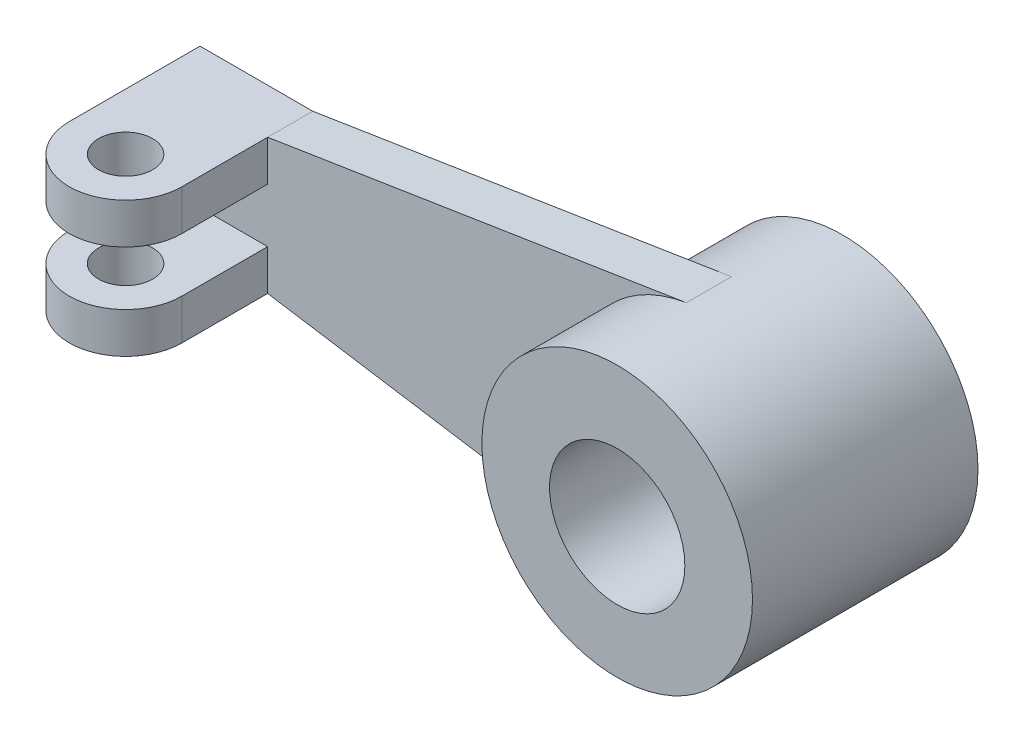
ISO-10303-21;
HEADER;
FILE_DESCRIPTION(('STEP AP214'),'2;1');
FILE_NAME('part.step','',(''),(''),'','','');
FILE_SCHEMA(('AUTOMOTIVE_DESIGN { 1 0 10303 214 1 1 1 1 }'));
ENDSEC;
DATA;
#1=APPLICATION_CONTEXT('core data for automotive mechanical design processes');
#2=APPLICATION_PROTOCOL_DEFINITION('international standard','automotive_design',2000,#1);
#3=PRODUCT_CONTEXT('',#1,'mechanical');
#4=PRODUCT('Part','Part','',(#3));
#5=PRODUCT_RELATED_PRODUCT_CATEGORY('part','',(#4));
#6=PRODUCT_DEFINITION_FORMATION('','',#4);
#7=PRODUCT_DEFINITION_CONTEXT('part definition',#1,'design');
#8=PRODUCT_DEFINITION('design','',#6,#7);
#9=PRODUCT_DEFINITION_SHAPE('','',#8);
#10=(LENGTH_UNIT() NAMED_UNIT(*) SI_UNIT(.MILLI.,.METRE.));
#11=(NAMED_UNIT(*) PLANE_ANGLE_UNIT() SI_UNIT($,.RADIAN.));
#12=(NAMED_UNIT(*) SI_UNIT($,.STERADIAN.) SOLID_ANGLE_UNIT());
#13=UNCERTAINTY_MEASURE_WITH_UNIT(LENGTH_MEASURE(1.E-05),#10,'distance_accuracy_value','');
#14=(GEOMETRIC_REPRESENTATION_CONTEXT(3) GLOBAL_UNCERTAINTY_ASSIGNED_CONTEXT((#13)) GLOBAL_UNIT_ASSIGNED_CONTEXT((#10,
#11,#12)) REPRESENTATION_CONTEXT('',''));
#15=CARTESIAN_POINT('',(0.,0.,0.));
#16=DIRECTION('',(0.,0.,1.));
#17=DIRECTION('',(1.,0.,0.));
#18=AXIS2_PLACEMENT_3D('',#15,#16,#17);
#19=CARTESIAN_POINT('',(0.,0.,5.));
#20=DIRECTION('',(0.,0.,1.));
#21=DIRECTION('',(1.,0.,0.));
#22=AXIS2_PLACEMENT_3D('',#19,#20,#21);
#23=PLANE('',#22);
#24=DIRECTION('',(0.987800769478854,0.155722958541715,0.));
#25=VECTOR('',#24,1.);
#26=CARTESIAN_POINT('',(-4.67168875625144,29.6340230843656,5.));
#27=LINE('',#26,#25);
#28=CARTESIAN_POINT('',(-97.5,15.,5.));
#29=VERTEX_POINT('',#28);
#30=CARTESIAN_POINT('',(-4.67168875625144,29.6340230843656,5.));
#31=VERTEX_POINT('',#30);
#32=EDGE_CURVE('E140',#29,#31,#27,.T.);
#33=ORIENTED_EDGE('',*,*,#32,.F.);
#34=DIRECTION('',(0.,1.,0.));
#35=VECTOR('',#34,1.);
#36=CARTESIAN_POINT('',(-97.5,6.00000000000002,5.));
#37=LINE('',#36,#35);
#38=CARTESIAN_POINT('',(-97.5,6.00000000000002,5.));
#39=VERTEX_POINT('',#38);
#40=EDGE_CURVE('E124',#39,#29,#37,.T.);
#41=ORIENTED_EDGE('',*,*,#40,.F.);
#42=DIRECTION('',(-1.,0.,0.));
#43=VECTOR('',#42,1.);
#44=CARTESIAN_POINT('',(0.,6.00000000000003,5.));
#45=LINE('',#44,#43);
#46=CARTESIAN_POINT('',(-122.5,6.00000000000002,5.));
#47=VERTEX_POINT('',#46);
#48=EDGE_CURVE('E129',#39,#47,#45,.T.);
#49=ORIENTED_EDGE('',*,*,#48,.T.);
#50=DIRECTION('',(0.,1.,0.));
#51=VECTOR('',#50,1.);
#52=CARTESIAN_POINT('',(-122.5,0.,5.));
#53=LINE('',#52,#51);
#54=CARTESIAN_POINT('',(-122.5,-6.00000000000002,5.));
#55=VERTEX_POINT('',#54);
#56=EDGE_CURVE('E55',#55,#47,#53,.T.);
#57=ORIENTED_EDGE('',*,*,#56,.F.);
#58=DIRECTION('',(-1.,0.,0.));
#59=VECTOR('',#58,1.);
#60=CARTESIAN_POINT('',(0.,-6.00000000000003,5.));
#61=LINE('',#60,#59);
#62=CARTESIAN_POINT('',(-97.5,-6.00000000000002,5.));
#63=VERTEX_POINT('',#62);
#64=EDGE_CURVE('E50',#63,#55,#61,.T.);
#65=ORIENTED_EDGE('',*,*,#64,.F.);
#66=DIRECTION('',(0.,-1.,0.));
#67=VECTOR('',#66,1.);
#68=CARTESIAN_POINT('',(-97.5,-6.00000000000002,5.));
#69=LINE('',#68,#67);
#70=CARTESIAN_POINT('',(-97.5,-15.,5.));
#71=VERTEX_POINT('',#70);
#72=EDGE_CURVE('E173',#63,#71,#69,.T.);
#73=ORIENTED_EDGE('',*,*,#72,.T.);
#74=DIRECTION('',(0.987800769478854,-0.155722958541715,0.));
#75=VECTOR('',#74,1.);
#76=CARTESIAN_POINT('',(-4.67168875625144,-29.6340230843656,5.));
#77=LINE('',#76,#75);
#78=CARTESIAN_POINT('',(-4.67168875625144,-29.6340230843656,5.));
#79=VERTEX_POINT('',#78);
#80=EDGE_CURVE('E185',#71,#79,#77,.T.);
#81=ORIENTED_EDGE('',*,*,#80,.T.);
#82=CARTESIAN_POINT('',(0.,0.,5.));
#83=DIRECTION('',(0.,0.,1.));
#84=DIRECTION('',(1.,0.,0.));
#85=AXIS2_PLACEMENT_3D('',#82,#83,#84);
#86=CIRCLE('',#85,30.);
#87=EDGE_CURVE('E180',#31,#79,#86,.T.);
#88=ORIENTED_EDGE('',*,*,#87,.F.);
#89=EDGE_LOOP('',(#33,#41,#49,#57,#65,#73,#81,#88));
#90=FACE_BOUND('',#89,.T.);
#91=ADVANCED_FACE('F35',(#90),#23,.T.);
#92=CARTESIAN_POINT('',(0.,0.,25.));
#93=DIRECTION('',(0.,0.,1.));
#94=DIRECTION('',(1.,0.,0.));
#95=AXIS2_PLACEMENT_3D('',#92,#93,#94);
#96=PLANE('',#95);
#97=CARTESIAN_POINT('',(0.,0.,25.));
#98=DIRECTION('',(0.,0.,1.));
#99=DIRECTION('',(1.,0.,0.));
#100=AXIS2_PLACEMENT_3D('',#97,#98,#99);
#101=CIRCLE('',#100,30.);
#102=CARTESIAN_POINT('',(30.,0.,25.));
#103=VERTEX_POINT('',#102);
#104=EDGE_CURVE('E11',#103,#103,#101,.T.);
#105=ORIENTED_EDGE('',*,*,#104,.T.);
#106=EDGE_LOOP('',(#105));
#107=FACE_BOUND('',#106,.T.);
#108=CARTESIAN_POINT('',(0.,-1.00715366406219,25.));
#109=DIRECTION('',(0.,0.,1.));
#110=DIRECTION('',(1.,0.,0.));
#111=AXIS2_PLACEMENT_3D('',#108,#109,#110);
#112=CIRCLE('',#111,15.);
#113=CARTESIAN_POINT('',(15.,-1.00715366406219,25.));
#114=VERTEX_POINT('',#113);
#115=EDGE_CURVE('E218',#114,#114,#112,.T.);
#116=ORIENTED_EDGE('',*,*,#115,.F.);
#117=EDGE_LOOP('',(#116));
#118=FACE_BOUND('',#117,.T.);
#119=ADVANCED_FACE('F241',(#107,#118),#96,.T.);
#120=CARTESIAN_POINT('',(0.,0.,-25.));
#121=DIRECTION('',(0.,0.,1.));
#122=DIRECTION('',(1.,0.,0.));
#123=AXIS2_PLACEMENT_3D('',#120,#121,#122);
#124=PLANE('',#123);
#125=CARTESIAN_POINT('',(0.,0.,-25.));
#126=DIRECTION('',(0.,0.,1.));
#127=DIRECTION('',(1.,0.,0.));
#128=AXIS2_PLACEMENT_3D('',#125,#126,#127);
#129=CIRCLE('',#128,30.);
#130=CARTESIAN_POINT('',(30.,0.,-25.));
#131=VERTEX_POINT('',#130);
#132=EDGE_CURVE('E39',#131,#131,#129,.T.);
#133=ORIENTED_EDGE('',*,*,#132,.F.);
#134=EDGE_LOOP('',(#133));
#135=FACE_BOUND('',#134,.T.);
#136=CARTESIAN_POINT('',(0.,-1.00715366406219,-25.));
#137=DIRECTION('',(0.,0.,1.));
#138=DIRECTION('',(1.,0.,0.));
#139=AXIS2_PLACEMENT_3D('',#136,#137,#138);
#140=CIRCLE('',#139,15.);
#141=CARTESIAN_POINT('',(15.,-1.00715366406219,-25.));
#142=VERTEX_POINT('',#141);
#143=EDGE_CURVE('E217',#142,#142,#140,.T.);
#144=ORIENTED_EDGE('',*,*,#143,.T.);
#145=EDGE_LOOP('',(#144));
#146=FACE_BOUND('',#145,.T.);
#147=ADVANCED_FACE('F224',(#135,#146),#124,.F.);
#148=CARTESIAN_POINT('',(0.,0.,25.));
#149=DIRECTION('',(0.,0.,-1.));
#150=DIRECTION('',(-1.,0.,0.));
#151=AXIS2_PLACEMENT_3D('',#148,#149,#150);
#152=CYLINDRICAL_SURFACE('',#151,30.);
#153=DIRECTION('',(0.,0.,-1.));
#154=VECTOR('',#153,1.);
#155=CARTESIAN_POINT('',(-4.67168875625144,29.6340230843656,5.));
#156=LINE('',#155,#154);
#157=CARTESIAN_POINT('',(-4.67168875625145,29.6340230843656,-5.));
#158=VERTEX_POINT('',#157);
#159=EDGE_CURVE('E214',#31,#158,#156,.T.);
#160=ORIENTED_EDGE('',*,*,#159,.F.);
#161=ORIENTED_EDGE('',*,*,#87,.T.);
#162=DIRECTION('',(0.,0.,-1.));
#163=VECTOR('',#162,1.);
#164=CARTESIAN_POINT('',(-4.67168875625144,-29.6340230843656,5.));
#165=LINE('',#164,#163);
#166=CARTESIAN_POINT('',(-4.67168875625144,-29.6340230843656,-5.));
#167=VERTEX_POINT('',#166);
#168=EDGE_CURVE('E188',#79,#167,#165,.T.);
#169=ORIENTED_EDGE('',*,*,#168,.T.);
#170=CARTESIAN_POINT('',(0.,0.,-5.));
#171=DIRECTION('',(0.,0.,1.));
#172=DIRECTION('',(1.,0.,0.));
#173=AXIS2_PLACEMENT_3D('',#170,#171,#172);
#174=CIRCLE('',#173,30.);
#175=EDGE_CURVE('E175',#158,#167,#174,.T.);
#176=ORIENTED_EDGE('',*,*,#175,.F.);
#177=EDGE_LOOP('',(#160,#161,#169,#176));
#178=FACE_BOUND('',#177,.T.);
#179=ORIENTED_EDGE('',*,*,#104,.F.);
#180=EDGE_LOOP('',(#179));
#181=FACE_BOUND('',#180,.T.);
#182=ORIENTED_EDGE('',*,*,#132,.T.);
#183=EDGE_LOOP('',(#182));
#184=FACE_BOUND('',#183,.T.);
#185=ADVANCED_FACE('F37',(#178,#181,#184),#152,.T.);
#186=CARTESIAN_POINT('',(0.,-1.00715366406219,25.));
#187=DIRECTION('',(0.,0.,-1.));
#188=DIRECTION('',(-1.,0.,0.));
#189=AXIS2_PLACEMENT_3D('',#186,#187,#188);
#190=CYLINDRICAL_SURFACE('',#189,15.);
#191=ORIENTED_EDGE('',*,*,#115,.T.);
#192=EDGE_LOOP('',(#191));
#193=FACE_BOUND('',#192,.T.);
#194=ORIENTED_EDGE('',*,*,#143,.F.);
#195=EDGE_LOOP('',(#194));
#196=FACE_BOUND('',#195,.T.);
#197=ADVANCED_FACE('F226',(#193,#196),#190,.F.);
#198=CARTESIAN_POINT('',(-4.67168875625144,29.6340230843656,5.));
#199=DIRECTION('',(-0.155722958541715,0.987800769478854,0.));
#200=DIRECTION('',(-0.987800769478854,-0.155722958541715,0.));
#201=AXIS2_PLACEMENT_3D('',#198,#199,#200);
#202=PLANE('',#201);
#203=DIRECTION('',(0.987800769478854,0.155722958541715,0.));
#204=VECTOR('',#203,1.);
#205=CARTESIAN_POINT('',(-4.67168875625144,29.6340230843656,-5.));
#206=LINE('',#205,#204);
#207=CARTESIAN_POINT('',(-97.5,15.,-5.));
#208=VERTEX_POINT('',#207);
#209=EDGE_CURVE('E191',#208,#158,#206,.T.);
#210=ORIENTED_EDGE('',*,*,#209,.F.);
#211=DIRECTION('',(0.,0.,-1.));
#212=VECTOR('',#211,1.);
#213=CARTESIAN_POINT('',(-97.5,15.,5.));
#214=LINE('',#213,#212);
#215=EDGE_CURVE('E212',#29,#208,#214,.T.);
#216=ORIENTED_EDGE('',*,*,#215,.F.);
#217=ORIENTED_EDGE('',*,*,#32,.T.);
#218=ORIENTED_EDGE('',*,*,#159,.T.);
#219=EDGE_LOOP('',(#210,#216,#217,#218));
#220=FACE_BOUND('',#219,.T.);
#221=ADVANCED_FACE('F228',(#220),#202,.T.);
#222=CARTESIAN_POINT('',(0.,15.,5.));
#223=DIRECTION('',(0.,1.,0.));
#224=DIRECTION('',(-1.,0.,0.));
#225=AXIS2_PLACEMENT_3D('',#222,#223,#224);
#226=PLANE('',#225);
#227=DIRECTION('',(1.,0.,0.));
#228=VECTOR('',#227,1.);
#229=CARTESIAN_POINT('',(0.,15.,-5.));
#230=LINE('',#229,#228);
#231=CARTESIAN_POINT('',(-122.5,15.,-5.));
#232=VERTEX_POINT('',#231);
#233=EDGE_CURVE('E194',#232,#208,#230,.T.);
#234=ORIENTED_EDGE('',*,*,#233,.F.);
#235=DIRECTION('',(0.,0.,-1.));
#236=VECTOR('',#235,1.);
#237=CARTESIAN_POINT('',(-122.5,15.,5.));
#238=LINE('',#237,#236);
#239=CARTESIAN_POINT('',(-122.5,15.,24.));
#240=VERTEX_POINT('',#239);
#241=EDGE_CURVE('E210',#240,#232,#238,.T.);
#242=ORIENTED_EDGE('',*,*,#241,.F.);
#243=CARTESIAN_POINT('',(-110.,15.,24.));
#244=DIRECTION('',(0.,-1.,0.));
#245=DIRECTION('',(1.,0.,0.));
#246=AXIS2_PLACEMENT_3D('',#243,#244,#245);
#247=CIRCLE('',#246,12.5);
#248=CARTESIAN_POINT('',(-97.5,15.,24.));
#249=VERTEX_POINT('',#248);
#250=EDGE_CURVE('E276',#249,#240,#247,.T.);
#251=ORIENTED_EDGE('',*,*,#250,.F.);
#252=DIRECTION('',(0.,0.,1.));
#253=VECTOR('',#252,1.);
#254=CARTESIAN_POINT('',(-97.5,15.,0.));
#255=LINE('',#254,#253);
#256=EDGE_CURVE('E279',#29,#249,#255,.T.);
#257=ORIENTED_EDGE('',*,*,#256,.F.);
#258=ORIENTED_EDGE('',*,*,#215,.T.);
#259=EDGE_LOOP('',(#234,#242,#251,#257,#258));
#260=FACE_BOUND('',#259,.T.);
#261=CARTESIAN_POINT('',(-110.,15.,24.));
#262=DIRECTION('',(0.,-1.,0.));
#263=DIRECTION('',(1.,0.,0.));
#264=AXIS2_PLACEMENT_3D('',#261,#262,#263);
#265=CIRCLE('',#264,6.);
#266=CARTESIAN_POINT('',(-104.,15.,24.));
#267=VERTEX_POINT('',#266);
#268=EDGE_CURVE('E130',#267,#267,#265,.T.);
#269=ORIENTED_EDGE('',*,*,#268,.T.);
#270=EDGE_LOOP('',(#269));
#271=FACE_BOUND('',#270,.T.);
#272=ADVANCED_FACE('F235',(#260,#271),#226,.T.);
#273=CARTESIAN_POINT('',(-122.5,0.,5.));
#274=DIRECTION('',(-1.,0.,0.));
#275=DIRECTION('',(0.,0.,1.));
#276=AXIS2_PLACEMENT_3D('',#273,#274,#275);
#277=PLANE('',#276);
#278=DIRECTION('',(0.,1.,0.));
#279=VECTOR('',#278,1.);
#280=CARTESIAN_POINT('',(-122.5,0.,-5.));
#281=LINE('',#280,#279);
#282=CARTESIAN_POINT('',(-122.5,-15.,-5.));
#283=VERTEX_POINT('',#282);
#284=EDGE_CURVE('E197',#283,#232,#281,.T.);
#285=ORIENTED_EDGE('',*,*,#284,.F.);
#286=DIRECTION('',(0.,0.,-1.));
#287=VECTOR('',#286,1.);
#288=CARTESIAN_POINT('',(-122.5,-15.,5.));
#289=LINE('',#288,#287);
#290=CARTESIAN_POINT('',(-122.5,-15.,24.));
#291=VERTEX_POINT('',#290);
#292=EDGE_CURVE('E208',#291,#283,#289,.T.);
#293=ORIENTED_EDGE('',*,*,#292,.F.);
#294=DIRECTION('',(0.,-1.,0.));
#295=VECTOR('',#294,1.);
#296=CARTESIAN_POINT('',(-122.5,-6.00000000000002,24.));
#297=LINE('',#296,#295);
#298=CARTESIAN_POINT('',(-122.5,-6.00000000000002,24.));
#299=VERTEX_POINT('',#298);
#300=EDGE_CURVE('E176',#299,#291,#297,.T.);
#301=ORIENTED_EDGE('',*,*,#300,.F.);
#302=DIRECTION('',(0.,0.,1.));
#303=VECTOR('',#302,1.);
#304=CARTESIAN_POINT('',(-122.5,-6.00000000000002,0.));
#305=LINE('',#304,#303);
#306=EDGE_CURVE('E158',#55,#299,#305,.T.);
#307=ORIENTED_EDGE('',*,*,#306,.F.);
#308=ORIENTED_EDGE('',*,*,#56,.T.);
#309=DIRECTION('',(0.,0.,1.));
#310=VECTOR('',#309,1.);
#311=CARTESIAN_POINT('',(-122.5,6.00000000000002,0.));
#312=LINE('',#311,#310);
#313=CARTESIAN_POINT('',(-122.5,6.00000000000002,24.));
#314=VERTEX_POINT('',#313);
#315=EDGE_CURVE('E135',#47,#314,#312,.T.);
#316=ORIENTED_EDGE('',*,*,#315,.T.);
#317=DIRECTION('',(0.,1.,0.));
#318=VECTOR('',#317,1.);
#319=CARTESIAN_POINT('',(-122.5,6.00000000000002,24.));
#320=LINE('',#319,#318);
#321=EDGE_CURVE('E141',#314,#240,#320,.T.);
#322=ORIENTED_EDGE('',*,*,#321,.T.);
#323=ORIENTED_EDGE('',*,*,#241,.T.);
#324=EDGE_LOOP('',(#285,#293,#301,#307,#308,#316,#322,#323));
#325=FACE_BOUND('',#324,.T.);
#326=ADVANCED_FACE('F262',(#325),#277,.T.);
#327=CARTESIAN_POINT('',(0.,-15.,5.));
#328=DIRECTION('',(0.,1.,0.));
#329=DIRECTION('',(-1.,0.,0.));
#330=AXIS2_PLACEMENT_3D('',#327,#328,#329);
#331=PLANE('',#330);
#332=DIRECTION('',(1.,0.,0.));
#333=VECTOR('',#332,1.);
#334=CARTESIAN_POINT('',(0.,-15.,-5.));
#335=LINE('',#334,#333);
#336=CARTESIAN_POINT('',(-97.5,-15.,-5.));
#337=VERTEX_POINT('',#336);
#338=EDGE_CURVE('E200',#283,#337,#335,.T.);
#339=ORIENTED_EDGE('',*,*,#338,.T.);
#340=DIRECTION('',(0.,0.,-1.));
#341=VECTOR('',#340,1.);
#342=CARTESIAN_POINT('',(-97.5,-15.,5.));
#343=LINE('',#342,#341);
#344=EDGE_CURVE('E205',#71,#337,#343,.T.);
#345=ORIENTED_EDGE('',*,*,#344,.F.);
#346=DIRECTION('',(0.,0.,1.));
#347=VECTOR('',#346,1.);
#348=CARTESIAN_POINT('',(-97.5,-15.,0.));
#349=LINE('',#348,#347);
#350=CARTESIAN_POINT('',(-97.5,-15.,24.));
#351=VERTEX_POINT('',#350);
#352=EDGE_CURVE('E165',#71,#351,#349,.T.);
#353=ORIENTED_EDGE('',*,*,#352,.T.);
#354=CARTESIAN_POINT('',(-110.,-15.,24.));
#355=DIRECTION('',(0.,-1.,0.));
#356=DIRECTION('',(1.,0.,0.));
#357=AXIS2_PLACEMENT_3D('',#354,#355,#356);
#358=CIRCLE('',#357,12.5);
#359=EDGE_CURVE('E168',#351,#291,#358,.T.);
#360=ORIENTED_EDGE('',*,*,#359,.T.);
#361=ORIENTED_EDGE('',*,*,#292,.T.);
#362=EDGE_LOOP('',(#339,#345,#353,#360,#361));
#363=FACE_BOUND('',#362,.T.);
#364=CARTESIAN_POINT('',(-110.,-15.,24.));
#365=DIRECTION('',(0.,-1.,0.));
#366=DIRECTION('',(1.,0.,0.));
#367=AXIS2_PLACEMENT_3D('',#364,#365,#366);
#368=CIRCLE('',#367,6.);
#369=CARTESIAN_POINT('',(-104.,-15.,24.));
#370=VERTEX_POINT('',#369);
#371=EDGE_CURVE('E155',#370,#370,#368,.T.);
#372=ORIENTED_EDGE('',*,*,#371,.F.);
#373=EDGE_LOOP('',(#372));
#374=FACE_BOUND('',#373,.T.);
#375=ADVANCED_FACE('F258',(#363,#374),#331,.F.);
#376=CARTESIAN_POINT('',(-4.67168875625144,-29.6340230843656,5.));
#377=DIRECTION('',(0.155722958541715,0.987800769478854,0.));
#378=DIRECTION('',(-0.987800769478854,0.155722958541715,0.));
#379=AXIS2_PLACEMENT_3D('',#376,#377,#378);
#380=PLANE('',#379);
#381=DIRECTION('',(0.987800769478854,-0.155722958541715,0.));
#382=VECTOR('',#381,1.);
#383=CARTESIAN_POINT('',(-4.67168875625144,-29.6340230843656,-5.));
#384=LINE('',#383,#382);
#385=EDGE_CURVE('E182',#337,#167,#384,.T.);
#386=ORIENTED_EDGE('',*,*,#385,.T.);
#387=ORIENTED_EDGE('',*,*,#168,.F.);
#388=ORIENTED_EDGE('',*,*,#80,.F.);
#389=ORIENTED_EDGE('',*,*,#344,.T.);
#390=EDGE_LOOP('',(#386,#387,#388,#389));
#391=FACE_BOUND('',#390,.T.);
#392=ADVANCED_FACE('F254',(#391),#380,.F.);
#393=CARTESIAN_POINT('',(0.,0.,-5.));
#394=DIRECTION('',(0.,0.,1.));
#395=DIRECTION('',(1.,0.,0.));
#396=AXIS2_PLACEMENT_3D('',#393,#394,#395);
#397=PLANE('',#396);
#398=ORIENTED_EDGE('',*,*,#175,.T.);
#399=ORIENTED_EDGE('',*,*,#385,.F.);
#400=ORIENTED_EDGE('',*,*,#338,.F.);
#401=ORIENTED_EDGE('',*,*,#284,.T.);
#402=ORIENTED_EDGE('',*,*,#233,.T.);
#403=ORIENTED_EDGE('',*,*,#209,.T.);
#404=EDGE_LOOP('',(#398,#399,#400,#401,#402,#403));
#405=FACE_BOUND('',#404,.T.);
#406=ADVANCED_FACE('F251',(#405),#397,.F.);
#407=CARTESIAN_POINT('',(-97.5,-6.00000000000002,0.));
#408=DIRECTION('',(1.,0.,0.));
#409=DIRECTION('',(0.,1.,0.));
#410=AXIS2_PLACEMENT_3D('',#407,#408,#409);
#411=PLANE('',#410);
#412=ORIENTED_EDGE('',*,*,#352,.F.);
#413=ORIENTED_EDGE('',*,*,#72,.F.);
#414=DIRECTION('',(0.,0.,1.));
#415=VECTOR('',#414,1.);
#416=CARTESIAN_POINT('',(-97.5,-6.00000000000002,0.));
#417=LINE('',#416,#415);
#418=CARTESIAN_POINT('',(-97.5,-6.00000000000002,24.));
#419=VERTEX_POINT('',#418);
#420=EDGE_CURVE('E151',#63,#419,#417,.T.);
#421=ORIENTED_EDGE('',*,*,#420,.T.);
#422=DIRECTION('',(0.,-1.,0.));
#423=VECTOR('',#422,1.);
#424=CARTESIAN_POINT('',(-97.5,-6.00000000000002,24.));
#425=LINE('',#424,#423);
#426=EDGE_CURVE('E164',#419,#351,#425,.T.);
#427=ORIENTED_EDGE('',*,*,#426,.T.);
#428=EDGE_LOOP('',(#412,#413,#421,#427));
#429=FACE_BOUND('',#428,.T.);
#430=ADVANCED_FACE('F249',(#429),#411,.T.);
#431=CARTESIAN_POINT('',(-110.,-6.00000000000002,24.));
#432=DIRECTION('',(0.,-1.,0.));
#433=DIRECTION('',(1.,0.,0.));
#434=AXIS2_PLACEMENT_3D('',#431,#432,#433);
#435=CYLINDRICAL_SURFACE('',#434,12.5);
#436=ORIENTED_EDGE('',*,*,#359,.F.);
#437=ORIENTED_EDGE('',*,*,#426,.F.);
#438=CARTESIAN_POINT('',(-110.,-6.00000000000002,24.));
#439=DIRECTION('',(0.,-1.,0.));
#440=DIRECTION('',(1.,0.,0.));
#441=AXIS2_PLACEMENT_3D('',#438,#439,#440);
#442=CIRCLE('',#441,12.5);
#443=EDGE_CURVE('E154',#419,#299,#442,.T.);
#444=ORIENTED_EDGE('',*,*,#443,.T.);
#445=ORIENTED_EDGE('',*,*,#300,.T.);
#446=EDGE_LOOP('',(#436,#437,#444,#445));
#447=FACE_BOUND('',#446,.T.);
#448=ADVANCED_FACE('F305',(#447),#435,.T.);
#449=CARTESIAN_POINT('',(-110.,-6.00000000000002,24.));
#450=DIRECTION('',(0.,-1.,0.));
#451=DIRECTION('',(1.,0.,0.));
#452=AXIS2_PLACEMENT_3D('',#449,#450,#451);
#453=CYLINDRICAL_SURFACE('',#452,6.);
#454=CARTESIAN_POINT('',(-110.,-6.00000000000002,24.));
#455=DIRECTION('',(0.,-1.,0.));
#456=DIRECTION('',(1.,0.,0.));
#457=AXIS2_PLACEMENT_3D('',#454,#455,#456);
#458=CIRCLE('',#457,6.);
#459=CARTESIAN_POINT('',(-104.,-6.00000000000002,24.));
#460=VERTEX_POINT('',#459);
#461=EDGE_CURVE('E161',#460,#460,#458,.T.);
#462=ORIENTED_EDGE('',*,*,#461,.F.);
#463=EDGE_LOOP('',(#462));
#464=FACE_BOUND('',#463,.T.);
#465=ORIENTED_EDGE('',*,*,#371,.T.);
#466=EDGE_LOOP('',(#465));
#467=FACE_BOUND('',#466,.T.);
#468=ADVANCED_FACE('F309',(#464,#467),#453,.F.);
#469=CARTESIAN_POINT('',(0.,-6.00000000000003,0.));
#470=DIRECTION('',(0.,-1.,0.));
#471=DIRECTION('',(1.,0.,0.));
#472=AXIS2_PLACEMENT_3D('',#469,#470,#471);
#473=PLANE('',#472);
#474=ORIENTED_EDGE('',*,*,#420,.F.);
#475=ORIENTED_EDGE('',*,*,#64,.T.);
#476=ORIENTED_EDGE('',*,*,#306,.T.);
#477=ORIENTED_EDGE('',*,*,#443,.F.);
#478=EDGE_LOOP('',(#474,#475,#476,#477));
#479=FACE_BOUND('',#478,.T.);
#480=ORIENTED_EDGE('',*,*,#461,.T.);
#481=EDGE_LOOP('',(#480));
#482=FACE_BOUND('',#481,.T.);
#483=ADVANCED_FACE('F293',(#479,#482),#473,.F.);
#484=CARTESIAN_POINT('',(-97.5,6.00000000000002,0.));
#485=DIRECTION('',(-1.,0.,0.));
#486=DIRECTION('',(0.,-1.,0.));
#487=AXIS2_PLACEMENT_3D('',#484,#485,#486);
#488=PLANE('',#487);
#489=ORIENTED_EDGE('',*,*,#256,.T.);
#490=DIRECTION('',(0.,1.,0.));
#491=VECTOR('',#490,1.);
#492=CARTESIAN_POINT('',(-97.5,6.00000000000002,24.));
#493=LINE('',#492,#491);
#494=CARTESIAN_POINT('',(-97.5,6.00000000000002,24.));
#495=VERTEX_POINT('',#494);
#496=EDGE_CURVE('E127',#495,#249,#493,.T.);
#497=ORIENTED_EDGE('',*,*,#496,.F.);
#498=DIRECTION('',(0.,0.,1.));
#499=VECTOR('',#498,1.);
#500=CARTESIAN_POINT('',(-97.5,6.00000000000002,0.));
#501=LINE('',#500,#499);
#502=EDGE_CURVE('E119',#39,#495,#501,.T.);
#503=ORIENTED_EDGE('',*,*,#502,.F.);
#504=ORIENTED_EDGE('',*,*,#40,.T.);
#505=EDGE_LOOP('',(#489,#497,#503,#504));
#506=FACE_BOUND('',#505,.T.);
#507=ADVANCED_FACE('F122',(#506),#488,.F.);
#508=CARTESIAN_POINT('',(-110.,6.00000000000002,24.));
#509=DIRECTION('',(0.,1.,0.));
#510=DIRECTION('',(-1.,0.,0.));
#511=AXIS2_PLACEMENT_3D('',#508,#509,#510);
#512=CYLINDRICAL_SURFACE('',#511,12.5);
#513=ORIENTED_EDGE('',*,*,#250,.T.);
#514=ORIENTED_EDGE('',*,*,#321,.F.);
#515=CARTESIAN_POINT('',(-110.,6.00000000000002,24.));
#516=DIRECTION('',(0.,-1.,0.));
#517=DIRECTION('',(1.,0.,0.));
#518=AXIS2_PLACEMENT_3D('',#515,#516,#517);
#519=CIRCLE('',#518,12.5);
#520=EDGE_CURVE('E147',#495,#314,#519,.T.);
#521=ORIENTED_EDGE('',*,*,#520,.F.);
#522=ORIENTED_EDGE('',*,*,#496,.T.);
#523=EDGE_LOOP('',(#513,#514,#521,#522));
#524=FACE_BOUND('',#523,.T.);
#525=ADVANCED_FACE('F283',(#524),#512,.T.);
#526=CARTESIAN_POINT('',(-110.,6.00000000000002,24.));
#527=DIRECTION('',(0.,1.,0.));
#528=DIRECTION('',(-1.,0.,0.));
#529=AXIS2_PLACEMENT_3D('',#526,#527,#528);
#530=CYLINDRICAL_SURFACE('',#529,6.);
#531=CARTESIAN_POINT('',(-110.,6.00000000000002,24.));
#532=DIRECTION('',(0.,-1.,0.));
#533=DIRECTION('',(1.,0.,0.));
#534=AXIS2_PLACEMENT_3D('',#531,#532,#533);
#535=CIRCLE('',#534,6.);
#536=CARTESIAN_POINT('',(-104.,6.00000000000002,24.));
#537=VERTEX_POINT('',#536);
#538=EDGE_CURVE('E142',#537,#537,#535,.T.);
#539=ORIENTED_EDGE('',*,*,#538,.T.);
#540=EDGE_LOOP('',(#539));
#541=FACE_BOUND('',#540,.T.);
#542=ORIENTED_EDGE('',*,*,#268,.F.);
#543=EDGE_LOOP('',(#542));
#544=FACE_BOUND('',#543,.T.);
#545=ADVANCED_FACE('F324',(#541,#544),#530,.F.);
#546=CARTESIAN_POINT('',(0.,6.00000000000003,0.));
#547=DIRECTION('',(0.,1.,0.));
#548=DIRECTION('',(1.,0.,0.));
#549=AXIS2_PLACEMENT_3D('',#546,#547,#548);
#550=PLANE('',#549);
#551=ORIENTED_EDGE('',*,*,#502,.T.);
#552=ORIENTED_EDGE('',*,*,#520,.T.);
#553=ORIENTED_EDGE('',*,*,#315,.F.);
#554=ORIENTED_EDGE('',*,*,#48,.F.);
#555=EDGE_LOOP('',(#551,#552,#553,#554));
#556=FACE_BOUND('',#555,.T.);
#557=ORIENTED_EDGE('',*,*,#538,.F.);
#558=EDGE_LOOP('',(#557));
#559=FACE_BOUND('',#558,.T.);
#560=ADVANCED_FACE('F132',(#556,#559),#550,.F.);
#561=CLOSED_SHELL('',(#91,#119,#147,#185,#197,#221,#272,#326,#375,#392,#406,#430,#448,#468,#483,
#507,#525,#545,#560));
#562=MANIFOLD_SOLID_BREP('B2',#561);
#563=ADVANCED_BREP_SHAPE_REPRESENTATION('',(#18,#562),#14);
#564=SHAPE_DEFINITION_REPRESENTATION(#9,#563);
ENDSEC;
END-ISO-10303-21;
